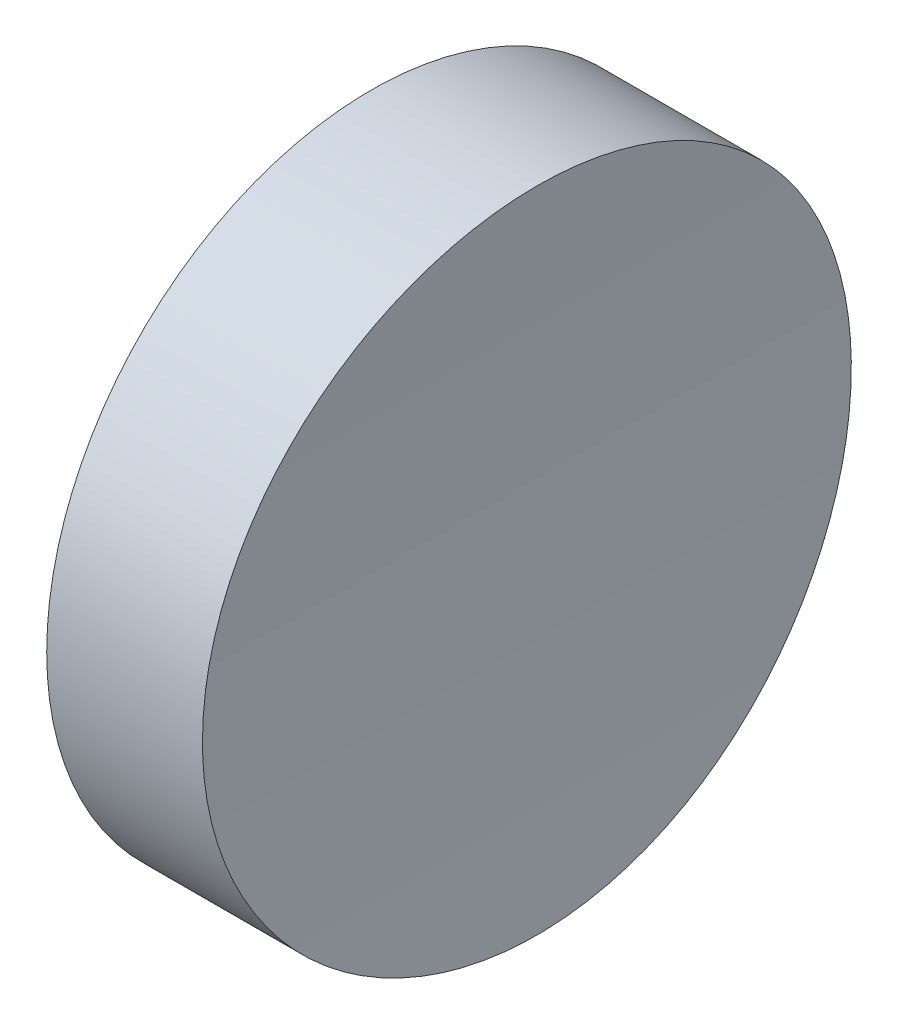
ISO-10303-21;
HEADER;
FILE_DESCRIPTION(('STEP AP214'),'2;1');
FILE_NAME('part.step','',(''),(''),'','','');
FILE_SCHEMA(('AUTOMOTIVE_DESIGN { 1 0 10303 214 1 1 1 1 }'));
ENDSEC;
DATA;
#1=APPLICATION_CONTEXT('core data for automotive mechanical design processes');
#2=APPLICATION_PROTOCOL_DEFINITION('international standard','automotive_design',2000,#1);
#3=PRODUCT_CONTEXT('',#1,'mechanical');
#4=PRODUCT('Part','Part','',(#3));
#5=PRODUCT_RELATED_PRODUCT_CATEGORY('part','',(#4));
#6=PRODUCT_DEFINITION_FORMATION('','',#4);
#7=PRODUCT_DEFINITION_CONTEXT('part definition',#1,'design');
#8=PRODUCT_DEFINITION('design','',#6,#7);
#9=PRODUCT_DEFINITION_SHAPE('','',#8);
#10=(LENGTH_UNIT() NAMED_UNIT(*) SI_UNIT(.MILLI.,.METRE.));
#11=(NAMED_UNIT(*) PLANE_ANGLE_UNIT() SI_UNIT($,.RADIAN.));
#12=(NAMED_UNIT(*) SI_UNIT($,.STERADIAN.) SOLID_ANGLE_UNIT());
#13=UNCERTAINTY_MEASURE_WITH_UNIT(LENGTH_MEASURE(1.E-05),#10,'distance_accuracy_value','');
#14=(GEOMETRIC_REPRESENTATION_CONTEXT(3) GLOBAL_UNCERTAINTY_ASSIGNED_CONTEXT((#13)) GLOBAL_UNIT_ASSIGNED_CONTEXT((#10,
#11,#12)) REPRESENTATION_CONTEXT('',''));
#15=CARTESIAN_POINT('',(0.,0.,0.));
#16=DIRECTION('',(0.,0.,1.));
#17=DIRECTION('',(1.,0.,0.));
#18=AXIS2_PLACEMENT_3D('',#15,#16,#17);
#19=CARTESIAN_POINT('',(10.,0.,0.));
#20=DIRECTION('',(-1.,0.,0.));
#21=DIRECTION('',(0.,0.,1.));
#22=AXIS2_PLACEMENT_3D('',#19,#20,#21);
#23=CYLINDRICAL_SURFACE('',#22,12.5);
#24=CARTESIAN_POINT('',(6.00000000000001,0.,12.5));
#25=CARTESIAN_POINT('',(5.99999950570731,0.350823394244744,12.5000028675567));
#26=CARTESIAN_POINT('',(6.00092499215883,0.701601062458643,12.4852248711399));
#27=CARTESIAN_POINT('',(6.00460002773076,1.40077506015951,12.4262185761951));
#28=CARTESIAN_POINT('',(6.00735004020318,1.7491707620156,12.3819827966325));
#29=CARTESIAN_POINT('',(6.01460106385118,2.44134253763402,12.2643069534608));
#30=CARTESIAN_POINT('',(6.0191038928527,2.78511343088805,12.1908365692167));
#31=CARTESIAN_POINT('',(6.02973251855975,3.46522609084671,12.0152216779054));
#32=CARTESIAN_POINT('',(6.03585831073117,3.80156787830334,11.9130772509454));
#33=CARTESIAN_POINT('',(6.04955556651053,4.46425369486591,11.6809091386842));
#34=CARTESIAN_POINT('',(6.05712625370854,4.79060298461518,11.5509004215809));
#35=CARTESIAN_POINT('',(6.07350127676271,5.43118554902062,11.2638982664122));
#36=CARTESIAN_POINT('',(6.08230563129455,5.7454186401659,11.1069044198288));
#37=CARTESIAN_POINT('',(6.10089667572317,6.35946808163436,10.7670919562141));
#38=CARTESIAN_POINT('',(6.11068313227074,6.65928783167089,10.5842794695534));
#39=CARTESIAN_POINT('',(6.13096354793488,7.24247288584447,10.1940998934515));
#40=CARTESIAN_POINT('',(6.14145750514847,7.52583823423567,9.98673287005427));
#41=CARTESIAN_POINT('',(6.16287065862682,8.07447956916569,9.5486218655922));
#42=CARTESIAN_POINT('',(6.17379039888906,8.33973113820361,9.31784733274768));
#43=CARTESIAN_POINT('',(6.19573274462482,8.84985778820492,8.83478422692142));
#44=CARTESIAN_POINT('',(6.20675535027834,9.09473283350395,8.58249561628584));
#45=CARTESIAN_POINT('',(6.22859151534572,9.56238286503092,8.05817846295991));
#46=CARTESIAN_POINT('',(6.23940506609775,9.78515693711716,7.78614910455674));
#47=CARTESIAN_POINT('',(6.26051597773516,10.2070143811261,7.22428346689211));
#48=CARTESIAN_POINT('',(6.27081333860393,10.4060977522867,6.93444718705789));
#49=CARTESIAN_POINT('',(6.29060755278436,10.7793104274797,6.33877700063591));
#50=CARTESIAN_POINT('',(6.30010375204836,10.9534194227291,6.03293034740701));
#51=CARTESIAN_POINT('',(6.3180159797542,11.2752493057727,5.40762412160928));
#52=CARTESIAN_POINT('',(6.32643200739658,11.4229701740366,5.08816453896549));
#53=CARTESIAN_POINT('',(6.34194390023485,11.6909650239585,4.43790493710456));
#54=CARTESIAN_POINT('',(6.34903977694469,11.8112392449995,4.10710501682405));
#55=CARTESIAN_POINT('',(6.36170889339104,12.0234785548578,3.43651662010671));
#56=CARTESIAN_POINT('',(6.36728213524511,12.115443683045,3.0967281561711));
#57=CARTESIAN_POINT('',(6.37674047137602,12.2703004238666,2.41103768551965));
#58=CARTESIAN_POINT('',(6.38062778210276,12.3332302155006,2.0651443315365));
#59=CARTESIAN_POINT('',(6.38661402477345,12.4297418499363,1.36927184685396));
#60=CARTESIAN_POINT('',(6.38871295812588,12.4633237158516,1.01929271937264));
#61=CARTESIAN_POINT('',(6.39106250885643,12.5008971743012,0.317747051041398));
#62=CARTESIAN_POINT('',(6.39131314511009,12.5048890690203,-0.0338194735606827));
#63=CARTESIAN_POINT('',(6.38995899024249,12.4832545622223,-0.736036269024501));
#64=CARTESIAN_POINT('',(6.3883542005052,12.4576281827981,-1.08668654056949));
#65=CARTESIAN_POINT('',(6.38333856540673,12.3769989136877,-1.78407942368159));
#66=CARTESIAN_POINT('',(6.37993026458508,12.3220374114244,-2.13082683955279));
#67=CARTESIAN_POINT('',(6.37140616939549,12.1831587875492,-2.81845181999068));
#68=CARTESIAN_POINT('',(6.36629037688299,12.0992416974015,-3.15932939093535));
#69=CARTESIAN_POINT('',(6.35449672575629,11.90305295897,-3.8327984131553));
#70=CARTESIAN_POINT('',(6.34781886017268,11.7907811841776,-4.16538982745344));
#71=CARTESIAN_POINT('',(6.33309071986894,11.5386857231379,-4.8199300789535));
#72=CARTESIAN_POINT('',(6.32504044369608,11.3988620077261,-5.14187890488957));
#73=CARTESIAN_POINT('',(6.30778972790056,11.0925510924441,-5.77308040875765));
#74=CARTESIAN_POINT('',(6.29858848199056,10.9260451777159,-6.08232398254793));
#75=CARTESIAN_POINT('',(6.2793012734813,10.5676247697362,-6.68568886949746));
#76=CARTESIAN_POINT('',(6.26921531061112,10.3757102687039,-6.97981017802589));
#77=CARTESIAN_POINT('',(6.24844428483407,9.96783183603421,-7.55085720626045));
#78=CARTESIAN_POINT('',(6.23775921626081,9.75186767691375,-7.82778276327533));
#79=CARTESIAN_POINT('',(6.21609242533048,9.29741923787459,-8.36248184352079));
#80=CARTESIAN_POINT('',(6.20511070261608,9.05893493082739,-8.62025534367951));
#81=CARTESIAN_POINT('',(6.18314226561325,8.56070281616704,-9.11525609597018));
#82=CARTESIAN_POINT('',(6.17215557511693,8.30091920997781,-9.35244731841202));
#83=CARTESIAN_POINT('',(6.15050766915107,7.76228357920137,-9.80410550702363));
#84=CARTESIAN_POINT('',(6.13984645407893,7.48343153133225,-10.018572445447));
#85=CARTESIAN_POINT('',(6.11915179188953,6.90863284181357,-10.4232592503485));
#86=CARTESIAN_POINT('',(6.10911834545936,6.6126861814545,-10.6134790902882));
#87=CARTESIAN_POINT('',(6.08996378405542,6.00579510268701,-10.9683171760509));
#88=CARTESIAN_POINT('',(6.08084266860212,5.69485069216158,-11.1329354353303));
#89=CARTESIAN_POINT('',(6.06377109115247,5.06015254646639,-11.4354031241965));
#90=CARTESIAN_POINT('',(6.05582069101931,4.73639813553404,-11.5732511393073));
#91=CARTESIAN_POINT('',(6.04131683959556,4.07839561091185,-11.8211800614639));
#92=CARTESIAN_POINT('',(6.03476338862831,3.74414749479314,-11.9312609620826));
#93=CARTESIAN_POINT('',(6.0232396757467,3.06754004962056,-12.1228636904028));
#94=CARTESIAN_POINT('',(6.01826939870053,2.72518079812566,-12.2043857910671));
#95=CARTESIAN_POINT('',(6.01005324747042,2.03478924007743,-12.338284911923));
#96=CARTESIAN_POINT('',(6.00680737079391,1.68675694172512,-12.3906619742432));
#97=CARTESIAN_POINT('',(6.00213626595485,0.988094412778153,-12.4658295437162));
#98=CARTESIAN_POINT('',(6.00070797418456,0.637469558326465,-12.4886698372609));
#99=CARTESIAN_POINT('',(5.9997024495983,-0.0644609564551345,-12.5047625229049));
#100=CARTESIAN_POINT('',(6.0001252147113,-0.415766616022894,-12.4980149481084));
#101=CARTESIAN_POINT('',(6.00280980801307,-1.11655501082828,-12.4549806722953));
#102=CARTESIAN_POINT('',(6.005071626977,-1.46603775520095,-12.4186941194485));
#103=CARTESIAN_POINT('',(6.01137019244275,-2.16069427273361,-12.3168433680926));
#104=CARTESIAN_POINT('',(6.01540693875532,-2.50586804635305,-12.2512791727054));
#105=CARTESIAN_POINT('',(6.02513707990685,-3.18917990534861,-12.0914082078022));
#106=CARTESIAN_POINT('',(6.03082915488927,-3.52732336699014,-11.9971243347479));
#107=CARTESIAN_POINT('',(6.04371021534452,-4.19446011026222,-11.7804714211403));
#108=CARTESIAN_POINT('',(6.0508991997357,-4.52345339850439,-11.6581024008809));
#109=CARTESIAN_POINT('',(6.06657097773424,-5.1699641022172,-11.3861519189431));
#110=CARTESIAN_POINT('',(6.07505378036716,-5.48748143761349,-11.2365702674304));
#111=CARTESIAN_POINT('',(6.0930735915393,-6.10879515069731,-10.9112596327516));
#112=CARTESIAN_POINT('',(6.10261060153349,-6.41259150944709,-10.7355306134981));
#113=CARTESIAN_POINT('',(6.12248287547525,-7.00471502847722,-10.3589209196804));
#114=CARTESIAN_POINT('',(6.13281918708642,-7.29302101718601,-10.1580070130507));
#115=CARTESIAN_POINT('',(6.15398645860921,-7.85168958021716,-9.73263754465294));
#116=CARTESIAN_POINT('',(6.16481741891406,-8.12205214027473,-9.50818196416997));
#117=CARTESIAN_POINT('',(6.18666764269773,-8.64292647155839,-9.03731593005726));
#118=CARTESIAN_POINT('',(6.19768690782474,-8.89343806892527,-8.79090528418025));
#119=CARTESIAN_POINT('',(6.21960178868573,-9.37283761479197,-8.27787242971716));
#120=CARTESIAN_POINT('',(6.23049740432982,-9.60172554757307,-8.01125020643909));
#121=CARTESIAN_POINT('',(6.2518712863992,-10.0365603544782,-7.45929364522592));
#122=CARTESIAN_POINT('',(6.26234895152774,-10.242474891454,-7.17393380737701));
#123=CARTESIAN_POINT('',(6.28257304979921,-10.6295317460505,-6.58685610178036));
#124=CARTESIAN_POINT('',(6.29231948215495,-10.8106740370039,-6.28513821642369));
#125=CARTESIAN_POINT('',(6.31080370249108,-11.1468939229179,-5.66748531506218));
#126=CARTESIAN_POINT('',(6.31954149511803,-11.3019716379532,-5.35155036456122));
#127=CARTESIAN_POINT('',(6.33575949050734,-11.5849540865926,-4.70770561583436));
#128=CARTESIAN_POINT('',(6.3432396946236,-11.7128588494505,-4.37979583050071));
#129=CARTESIAN_POINT('',(6.35672420998251,-11.940495547071,-3.71457417939862));
#130=CARTESIAN_POINT('',(6.36272958362099,-12.0402477693223,-3.37726927758809));
#131=CARTESIAN_POINT('',(6.37310011550659,-12.2109854768174,-2.69543078427299));
#132=CARTESIAN_POINT('',(6.37746527428098,-12.2819709713087,-2.35089719509224));
#133=CARTESIAN_POINT('',(6.38443068432943,-12.3946633668293,-1.65705960879676));
#134=CARTESIAN_POINT('',(6.38703094997255,-12.4363705062315,-1.30775565054413));
#135=CARTESIAN_POINT('',(6.390392308396,-12.4902060692884,-0.606867086379857));
#136=CARTESIAN_POINT('',(6.3911534033921,-12.5023345285787,-0.2552824832164));
#137=CARTESIAN_POINT('',(6.39081496960766,-12.4969299379352,0.447054469449512));
#138=CARTESIAN_POINT('',(6.38971862778704,-12.4794476935797,0.79780721253349));
#139=CARTESIAN_POINT('',(6.38570265472224,-12.4150446259058,1.49658860228934));
#140=CARTESIAN_POINT('',(6.38278302570639,-12.3681238385655,1.84461725228992));
#141=CARTESIAN_POINT('',(6.37520362360942,-12.2451810263819,2.53547676783789));
#142=CARTESIAN_POINT('',(6.37054384870563,-12.169158971057,2.87830762794054));
#143=CARTESIAN_POINT('',(6.35961675202638,-11.9885591762643,3.55633718856525));
#144=CARTESIAN_POINT('',(6.35334942939907,-11.8839814216648,3.89153588504287));
#145=CARTESIAN_POINT('',(6.33938545101152,-11.6470198896726,4.55192177671166));
#146=CARTESIAN_POINT('',(6.33168880830216,-11.5146363661683,4.87710906328373));
#147=CARTESIAN_POINT('',(6.31508464270183,-11.2230074191611,5.51517437643595));
#148=CARTESIAN_POINT('',(6.30617711984065,-11.0637619963193,5.82805240331906));
#149=CARTESIAN_POINT('',(6.28740397561566,-10.7195467206476,6.43928069484894));
#150=CARTESIAN_POINT('',(6.27753838077614,-10.5345775799192,6.7376313613435));
#151=CARTESIAN_POINT('',(6.25712818938603,-10.1402232121164,7.31770969498245));
#152=CARTESIAN_POINT('',(6.24658359252723,-9.93083797395927,7.59943735458138));
#153=CARTESIAN_POINT('',(6.22509641797758,-9.48877907784586,8.14471946228064));
#154=CARTESIAN_POINT('',(6.21415323149851,-9.25606875572914,8.40824416369981));
#155=CARTESIAN_POINT('',(6.1921949450831,-8.76928623178,8.914763010988));
#156=CARTESIAN_POINT('',(6.18117984479425,-8.51521392516225,9.15775705613782));
#157=CARTESIAN_POINT('',(6.15938707860191,-7.98743898033064,9.62155195906245));
#158=CARTESIAN_POINT('',(6.1486094729119,-7.71373143705191,9.84234723806549));
#159=CARTESIAN_POINT('',(6.12760010253426,-7.1486831927853,10.2601061288948));
#160=CARTESIAN_POINT('',(6.1173683295599,-6.85734275963961,10.4570701025804));
#161=CARTESIAN_POINT('',(6.0977281383998,-6.25871259130722,10.8260004516899));
#162=CARTESIAN_POINT('',(6.0883207628333,-5.9514034206412,10.9979353492688));
#163=CARTESIAN_POINT('',(6.0706110095799,-5.32335416562616,11.3152858742779));
#164=CARTESIAN_POINT('',(6.06230863507061,-5.00261404265764,11.4607014254477));
#165=CARTESIAN_POINT('',(6.04705302296769,-4.35031957813252,11.7238329207213));
#166=CARTESIAN_POINT('',(6.04009837937715,-4.01877693266971,11.8415777593978));
#167=CARTESIAN_POINT('',(6.02772631552782,-3.34703298314696,12.0486889673462));
#168=CARTESIAN_POINT('',(6.02230850164118,-3.00683392062326,12.1380626040271));
#169=CARTESIAN_POINT('',(6.01191595523076,-2.22642959352072,12.3082476794833));
#170=CARTESIAN_POINT('',(6.00746419002872,-1.7842325615361,12.3800906987553));
#171=CARTESIAN_POINT('',(6.00150652955841,-0.894665570939045,12.4759649979119));
#172=CARTESIAN_POINT('',(6.00000063021727,-0.447295619479398,12.4999963438996));
#173=CARTESIAN_POINT('',(6.00000000000001,0.,12.5));
#174=B_SPLINE_CURVE_WITH_KNOTS('',3,(#24,#25,#26,#27,#28,#29,#30,#31,#32,#33,#34,#35,#36,#37,
#38,#39,#40,#41,#42,#43,#44,#45,#46,#47,#48,#49,#50,#51,#52,#53,#54,#55,#56,#57,#58,#59,#60,#61,
#62,#63,#64,#65,#66,#67,#68,#69,#70,#71,#72,#73,#74,#75,#76,#77,#78,#79,#80,#81,#82,#83,#84,#85,
#86,#87,#88,#89,#90,#91,#92,#93,#94,#95,#96,#97,#98,#99,#100,#101,#102,#103,#104,#105,#106,#107,
#108,#109,#110,#111,#112,#113,#114,#115,#116,#117,#118,#119,#120,#121,#122,#123,#124,#125,#126,
#127,#128,#129,#130,#131,#132,#133,#134,#135,#136,#137,#138,#139,#140,#141,#142,#143,#144,#145,
#146,#147,#148,#149,#150,#151,#152,#153,#154,#155,#156,#157,#158,#159,#160,#161,#162,#163,#164,
#165,#166,#167,#168,#169,#170,#171,#172,#173),.UNSPECIFIED.,.T.,.F.,(4,2,2,2,2,2,2,2,2,2,2,2,2,
2,2,2,2,2,2,2,2,2,2,2,2,2,2,2,2,2,2,2,2,2,2,2,2,2,2,2,2,2,2,2,2,2,2,2,2,2,2,2,2,2,2,2,2,2,2,2,2,
2,2,2,2,2,2,2,2,2,2,2,2,2,4),(0.,1.05207930200567,2.10442588973256,3.15786677422096,
4.21130471571995,5.26417818123077,6.31706758721142,7.36970741442568,8.42234441043155,
9.47637344690187,10.5304043281664,11.5844787881554,12.6385532820489,13.6934801321384,
14.748407762995,15.8033261926753,16.8582431552553,17.9117690105761,18.9652940361706,
20.0188083027284,21.0723217834521,22.1243528296924,23.1763827327569,24.2284173296854,
25.280453040224,26.3332299031802,27.3860070885227,28.4387942328118,29.4915826453389,
30.5461782948687,31.6007752320461,32.6553733234679,33.7099708605874,34.7646241049809,
35.8192775934858,36.8739210014231,37.9285628848946,38.9814247649937,40.0342854671075,
41.0871408880213,42.1399961966705,43.1920143146484,44.2440316724525,45.2960563693726,
46.3480825182569,47.4015117493782,48.4549418179518,49.5083811116846,50.5618211711794,
51.6167258180708,52.6716316005569,53.7265325231553,54.7814323100687,55.8355699549763,
56.8897072610131,57.9438359845759,58.9979634381511,60.0502840680685,61.1026034118969,
62.1549238579629,63.2072448616611,64.2595562572651,65.3118676269697,66.3641498716651,
67.4164325940049,68.4703961175896,69.5243648114036,70.5785977194599,71.6328146178194,
72.6883461064152,73.7438806303051,74.7983079870834,75.8524650292664,77.1938553740338,
78.5352438642318),.UNSPECIFIED.);
#175=CARTESIAN_POINT('',(6.00000000000001,0.,12.5));
#176=VERTEX_POINT('',#175);
#177=EDGE_CURVE('E10',#176,#176,#174,.T.);
#178=ORIENTED_EDGE('',*,*,#177,.T.);
#179=EDGE_LOOP('',(#178));
#180=FACE_BOUND('',#179,.T.);
#181=CARTESIAN_POINT('',(0.,0.,0.));
#182=DIRECTION('',(1.,0.,0.));
#183=DIRECTION('',(0.,0.,-1.));
#184=AXIS2_PLACEMENT_3D('',#181,#182,#183);
#185=CIRCLE('',#184,12.5);
#186=CARTESIAN_POINT('',(0.,0.,-12.5));
#187=VERTEX_POINT('',#186);
#188=EDGE_CURVE('E46',#187,#187,#185,.T.);
#189=ORIENTED_EDGE('',*,*,#188,.T.);
#190=EDGE_LOOP('',(#189));
#191=FACE_BOUND('',#190,.T.);
#192=ADVANCED_FACE('F35',(#180,#191),#23,.T.);
#193=CARTESIAN_POINT('',(0.,0.,0.));
#194=DIRECTION('',(1.,0.,0.));
#195=DIRECTION('',(0.,0.,-1.));
#196=AXIS2_PLACEMENT_3D('',#193,#194,#195);
#197=PLANE('',#196);
#198=ORIENTED_EDGE('',*,*,#188,.F.);
#199=EDGE_LOOP('',(#198));
#200=FACE_BOUND('',#199,.T.);
#201=ADVANCED_FACE('F53',(#200),#197,.F.);
#202=CARTESIAN_POINT('',(206.,0.,-12.5));
#203=DIRECTION('',(0.,0.,1.));
#204=DIRECTION('',(1.,0.,0.));
#205=AXIS2_PLACEMENT_3D('',#202,#203,#204);
#206=CYLINDRICAL_SURFACE('',#205,200.);
#207=ORIENTED_EDGE('',*,*,#177,.F.);
#208=EDGE_LOOP('',(#207));
#209=FACE_BOUND('',#208,.T.);
#210=ADVANCED_FACE('F55',(#209),#206,.F.);
#211=CLOSED_SHELL('',(#192,#201,#210));
#212=MANIFOLD_SOLID_BREP('B2',#211);
#213=ADVANCED_BREP_SHAPE_REPRESENTATION('',(#18,#212),#14);
#214=SHAPE_DEFINITION_REPRESENTATION(#9,#213);
ENDSEC;
END-ISO-10303-21;
